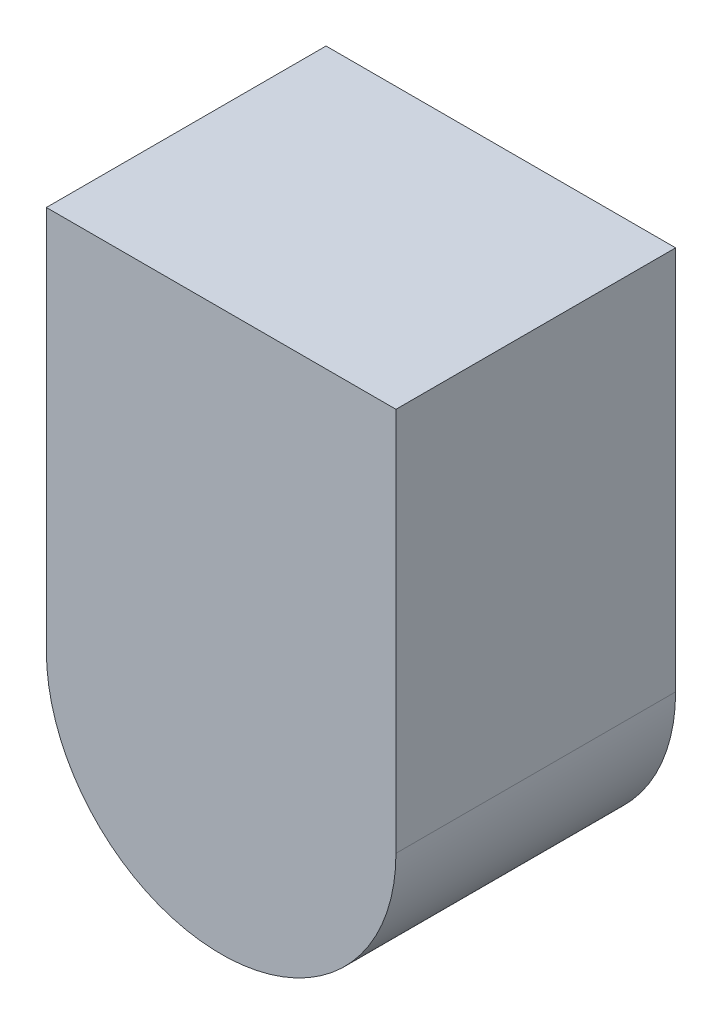
ISO-10303-21;
HEADER;
FILE_DESCRIPTION(('STEP AP214'),'2;1');
FILE_NAME('part.step','',(''),(''),'','','');
FILE_SCHEMA(('AUTOMOTIVE_DESIGN { 1 0 10303 214 1 1 1 1 }'));
ENDSEC;
DATA;
#1=APPLICATION_CONTEXT('core data for automotive mechanical design processes');
#2=APPLICATION_PROTOCOL_DEFINITION('international standard','automotive_design',2000,#1);
#3=PRODUCT_CONTEXT('',#1,'mechanical');
#4=PRODUCT('Part','Part','',(#3));
#5=PRODUCT_RELATED_PRODUCT_CATEGORY('part','',(#4));
#6=PRODUCT_DEFINITION_FORMATION('','',#4);
#7=PRODUCT_DEFINITION_CONTEXT('part definition',#1,'design');
#8=PRODUCT_DEFINITION('design','',#6,#7);
#9=PRODUCT_DEFINITION_SHAPE('','',#8);
#10=(LENGTH_UNIT() NAMED_UNIT(*) SI_UNIT(.MILLI.,.METRE.));
#11=(NAMED_UNIT(*) PLANE_ANGLE_UNIT() SI_UNIT($,.RADIAN.));
#12=(NAMED_UNIT(*) SI_UNIT($,.STERADIAN.) SOLID_ANGLE_UNIT());
#13=UNCERTAINTY_MEASURE_WITH_UNIT(LENGTH_MEASURE(1.E-05),#10,'distance_accuracy_value','');
#14=(GEOMETRIC_REPRESENTATION_CONTEXT(3) GLOBAL_UNCERTAINTY_ASSIGNED_CONTEXT((#13)) GLOBAL_UNIT_ASSIGNED_CONTEXT((#10,
#11,#12)) REPRESENTATION_CONTEXT('',''));
#15=CARTESIAN_POINT('',(0.,0.,0.));
#16=DIRECTION('',(0.,0.,1.));
#17=DIRECTION('',(1.,0.,0.));
#18=AXIS2_PLACEMENT_3D('',#15,#16,#17);
#19=CARTESIAN_POINT('',(0.124999999999991,1.,0.));
#20=DIRECTION('',(0.,1.,0.));
#21=DIRECTION('',(-1.,0.,0.));
#22=AXIS2_PLACEMENT_3D('',#19,#20,#21);
#23=PLANE('',#22);
#24=DIRECTION('',(-1.,0.,0.));
#25=VECTOR('',#24,1.);
#26=CARTESIAN_POINT('',(0.124999999999991,1.,0.));
#27=LINE('',#26,#25);
#28=CARTESIAN_POINT('',(0.124999999999991,1.,0.));
#29=VERTEX_POINT('',#28);
#30=CARTESIAN_POINT('',(-0.125000000000004,0.999999999999999,0.));
#31=VERTEX_POINT('',#30);
#32=EDGE_CURVE('E11',#29,#31,#27,.T.);
#33=ORIENTED_EDGE('',*,*,#32,.T.);
#34=DIRECTION('',(0.,0.,1.));
#35=VECTOR('',#34,1.);
#36=CARTESIAN_POINT('',(-0.125000000000004,0.999999999999999,0.));
#37=LINE('',#36,#35);
#38=CARTESIAN_POINT('',(-0.125000000000004,0.999999999999999,0.2));
#39=VERTEX_POINT('',#38);
#40=EDGE_CURVE('E24',#31,#39,#37,.T.);
#41=ORIENTED_EDGE('',*,*,#40,.T.);
#42=DIRECTION('',(-1.,0.,0.));
#43=VECTOR('',#42,1.);
#44=CARTESIAN_POINT('',(0.124999999999991,1.,0.2));
#45=LINE('',#44,#43);
#46=CARTESIAN_POINT('',(0.124999999999991,1.,0.2));
#47=VERTEX_POINT('',#46);
#48=EDGE_CURVE('E75',#47,#39,#45,.T.);
#49=ORIENTED_EDGE('',*,*,#48,.F.);
#50=DIRECTION('',(0.,0.,1.));
#51=VECTOR('',#50,1.);
#52=CARTESIAN_POINT('',(0.124999999999991,1.,0.));
#53=LINE('',#52,#51);
#54=EDGE_CURVE('E86',#29,#47,#53,.T.);
#55=ORIENTED_EDGE('',*,*,#54,.F.);
#56=EDGE_LOOP('',(#33,#41,#49,#55));
#57=FACE_BOUND('',#56,.T.);
#58=ADVANCED_FACE('F17',(#57),#23,.T.);
#59=CARTESIAN_POINT('',(0.124999999999997,0.724999999999999,0.));
#60=DIRECTION('',(1.,0.,0.));
#61=DIRECTION('',(0.,1.,0.));
#62=AXIS2_PLACEMENT_3D('',#59,#60,#61);
#63=PLANE('',#62);
#64=DIRECTION('',(0.,1.,0.));
#65=VECTOR('',#64,1.);
#66=CARTESIAN_POINT('',(0.124999999999997,0.725,0.));
#67=LINE('',#66,#65);
#68=CARTESIAN_POINT('',(0.124999999999992,0.724999999999999,0.));
#69=VERTEX_POINT('',#68);
#70=EDGE_CURVE('E83',#69,#29,#67,.T.);
#71=ORIENTED_EDGE('',*,*,#70,.T.);
#72=ORIENTED_EDGE('',*,*,#54,.T.);
#73=DIRECTION('',(0.,1.,0.));
#74=VECTOR('',#73,1.);
#75=CARTESIAN_POINT('',(0.124999999999997,0.725,0.2));
#76=LINE('',#75,#74);
#77=CARTESIAN_POINT('',(0.124999999999992,0.724999999999999,0.2));
#78=VERTEX_POINT('',#77);
#79=EDGE_CURVE('E81',#78,#47,#76,.T.);
#80=ORIENTED_EDGE('',*,*,#79,.F.);
#81=DIRECTION('',(0.,0.,1.));
#82=VECTOR('',#81,1.);
#83=CARTESIAN_POINT('',(0.124999999999992,0.724999999999999,0.));
#84=LINE('',#83,#82);
#85=EDGE_CURVE('E61',#69,#78,#84,.T.);
#86=ORIENTED_EDGE('',*,*,#85,.F.);
#87=EDGE_LOOP('',(#71,#72,#80,#86));
#88=FACE_BOUND('',#87,.T.);
#89=ADVANCED_FACE('F91',(#88),#63,.T.);
#90=CARTESIAN_POINT('',(0.,0.724999999999999,0.));
#91=DIRECTION('',(0.,0.,1.));
#92=DIRECTION('',(-1.,0.,0.));
#93=AXIS2_PLACEMENT_3D('',#90,#91,#92);
#94=CYLINDRICAL_SURFACE('',#93,0.125);
#95=CARTESIAN_POINT('',(0.,0.724999999999999,0.));
#96=DIRECTION('',(0.,0.,1.));
#97=DIRECTION('',(-1.,0.,0.));
#98=AXIS2_PLACEMENT_3D('',#95,#96,#97);
#99=CIRCLE('',#98,0.125);
#100=CARTESIAN_POINT('',(-0.125000000000002,0.724999999999999,0.));
#101=VERTEX_POINT('',#100);
#102=EDGE_CURVE('E65',#101,#69,#99,.T.);
#103=ORIENTED_EDGE('',*,*,#102,.T.);
#104=ORIENTED_EDGE('',*,*,#85,.T.);
#105=CARTESIAN_POINT('',(0.,0.724999999999999,0.2));
#106=DIRECTION('',(0.,0.,1.));
#107=DIRECTION('',(-1.,0.,0.));
#108=AXIS2_PLACEMENT_3D('',#105,#106,#107);
#109=CIRCLE('',#108,0.125);
#110=CARTESIAN_POINT('',(-0.125000000000002,0.724999999999999,0.2));
#111=VERTEX_POINT('',#110);
#112=EDGE_CURVE('E54',#111,#78,#109,.T.);
#113=ORIENTED_EDGE('',*,*,#112,.F.);
#114=DIRECTION('',(0.,0.,1.));
#115=VECTOR('',#114,1.);
#116=CARTESIAN_POINT('',(-0.125000000000002,0.724999999999999,0.));
#117=LINE('',#116,#115);
#118=EDGE_CURVE('E58',#101,#111,#117,.T.);
#119=ORIENTED_EDGE('',*,*,#118,.F.);
#120=EDGE_LOOP('',(#103,#104,#113,#119));
#121=FACE_BOUND('',#120,.T.);
#122=ADVANCED_FACE('F57',(#121),#94,.T.);
#123=CARTESIAN_POINT('',(-0.125000000000004,0.999999999999999,0.));
#124=DIRECTION('',(-1.,0.,0.));
#125=DIRECTION('',(0.,-1.,0.));
#126=AXIS2_PLACEMENT_3D('',#123,#124,#125);
#127=PLANE('',#126);
#128=DIRECTION('',(0.,-1.,0.));
#129=VECTOR('',#128,1.);
#130=CARTESIAN_POINT('',(-0.125000000000004,0.999999999999999,0.));
#131=LINE('',#130,#129);
#132=EDGE_CURVE('E71',#31,#101,#131,.T.);
#133=ORIENTED_EDGE('',*,*,#132,.T.);
#134=ORIENTED_EDGE('',*,*,#118,.T.);
#135=DIRECTION('',(0.,-1.,0.));
#136=VECTOR('',#135,1.);
#137=CARTESIAN_POINT('',(-0.125000000000004,0.999999999999999,0.2));
#138=LINE('',#137,#136);
#139=EDGE_CURVE('E70',#39,#111,#138,.T.);
#140=ORIENTED_EDGE('',*,*,#139,.F.);
#141=ORIENTED_EDGE('',*,*,#40,.F.);
#142=EDGE_LOOP('',(#133,#134,#140,#141));
#143=FACE_BOUND('',#142,.T.);
#144=ADVANCED_FACE('F69',(#143),#127,.T.);
#145=CARTESIAN_POINT('',(0.,0.799999999999999,0.2));
#146=DIRECTION('',(0.,0.,1.));
#147=DIRECTION('',(1.,0.,0.));
#148=AXIS2_PLACEMENT_3D('',#145,#146,#147);
#149=PLANE('',#148);
#150=ORIENTED_EDGE('',*,*,#139,.T.);
#151=ORIENTED_EDGE('',*,*,#112,.T.);
#152=ORIENTED_EDGE('',*,*,#79,.T.);
#153=ORIENTED_EDGE('',*,*,#48,.T.);
#154=EDGE_LOOP('',(#150,#151,#152,#153));
#155=FACE_BOUND('',#154,.T.);
#156=ADVANCED_FACE('F74',(#155),#149,.T.);
#157=CARTESIAN_POINT('',(0.,0.799999999999999,0.));
#158=DIRECTION('',(0.,0.,1.));
#159=DIRECTION('',(1.,0.,0.));
#160=AXIS2_PLACEMENT_3D('',#157,#158,#159);
#161=PLANE('',#160);
#162=ORIENTED_EDGE('',*,*,#132,.F.);
#163=ORIENTED_EDGE('',*,*,#32,.F.);
#164=ORIENTED_EDGE('',*,*,#70,.F.);
#165=ORIENTED_EDGE('',*,*,#102,.F.);
#166=EDGE_LOOP('',(#162,#163,#164,#165));
#167=FACE_BOUND('',#166,.T.);
#168=ADVANCED_FACE('F89',(#167),#161,.F.);
#169=CLOSED_SHELL('',(#58,#89,#122,#144,#156,#168));
#170=MANIFOLD_SOLID_BREP('B1',#169);
#171=ADVANCED_BREP_SHAPE_REPRESENTATION('',(#18,#170),#14);
#172=SHAPE_DEFINITION_REPRESENTATION(#9,#171);
ENDSEC;
END-ISO-10303-21;
